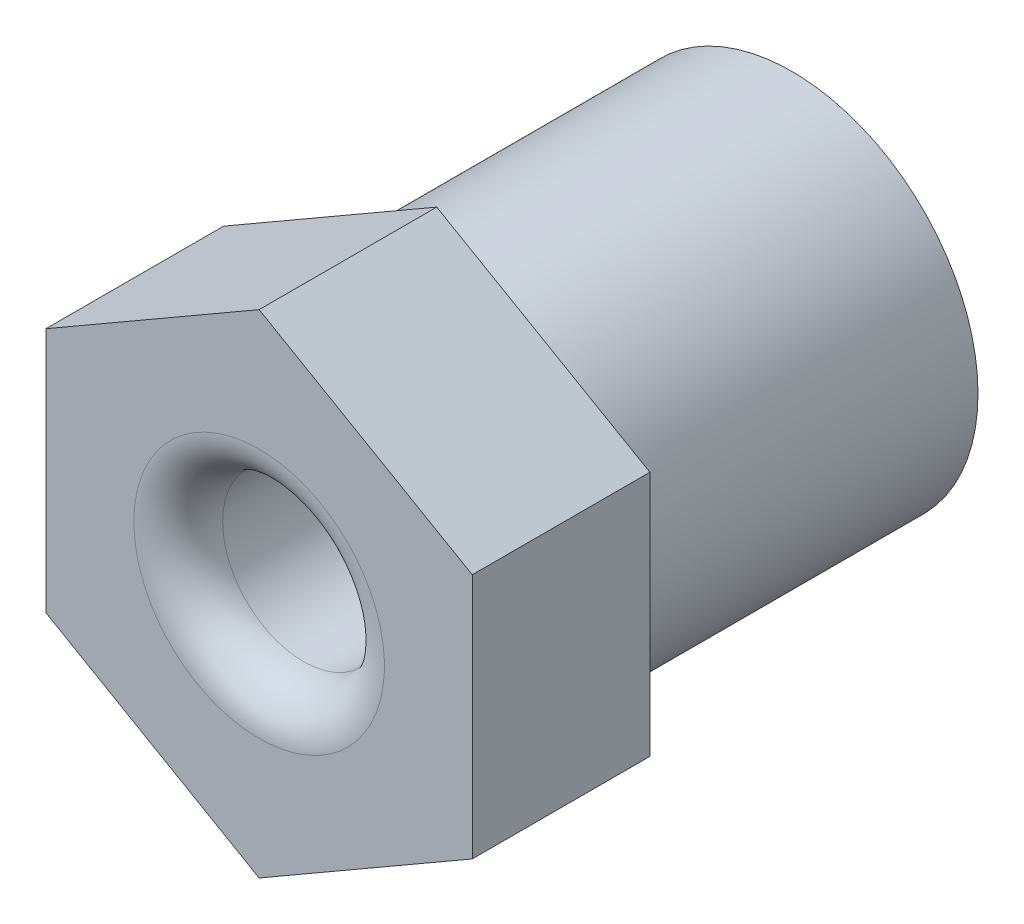
ISO-10303-21;
HEADER;
FILE_DESCRIPTION(('STEP AP214'),'2;1');
FILE_NAME('part.step','',(''),(''),'','','');
FILE_SCHEMA(('AUTOMOTIVE_DESIGN { 1 0 10303 214 1 1 1 1 }'));
ENDSEC;
DATA;
#1=APPLICATION_CONTEXT('core data for automotive mechanical design processes');
#2=APPLICATION_PROTOCOL_DEFINITION('international standard','automotive_design',2000,#1);
#3=PRODUCT_CONTEXT('',#1,'mechanical');
#4=PRODUCT('Part','Part','',(#3));
#5=PRODUCT_RELATED_PRODUCT_CATEGORY('part','',(#4));
#6=PRODUCT_DEFINITION_FORMATION('','',#4);
#7=PRODUCT_DEFINITION_CONTEXT('part definition',#1,'design');
#8=PRODUCT_DEFINITION('design','',#6,#7);
#9=PRODUCT_DEFINITION_SHAPE('','',#8);
#10=(LENGTH_UNIT() NAMED_UNIT(*) SI_UNIT(.MILLI.,.METRE.));
#11=(NAMED_UNIT(*) PLANE_ANGLE_UNIT() SI_UNIT($,.RADIAN.));
#12=(NAMED_UNIT(*) SI_UNIT($,.STERADIAN.) SOLID_ANGLE_UNIT());
#13=UNCERTAINTY_MEASURE_WITH_UNIT(LENGTH_MEASURE(1.E-05),#10,'distance_accuracy_value','');
#14=(GEOMETRIC_REPRESENTATION_CONTEXT(3) GLOBAL_UNCERTAINTY_ASSIGNED_CONTEXT((#13)) GLOBAL_UNIT_ASSIGNED_CONTEXT((#10,
#11,#12)) REPRESENTATION_CONTEXT('',''));
#15=CARTESIAN_POINT('',(0.,0.,0.));
#16=DIRECTION('',(0.,0.,1.));
#17=DIRECTION('',(1.,0.,0.));
#18=AXIS2_PLACEMENT_3D('',#15,#16,#17);
#19=CARTESIAN_POINT('',(-3.65791116486798,3.45094953686021,0.));
#20=DIRECTION('',(0.,0.,1.));
#21=DIRECTION('',(1.,0.,0.));
#22=AXIS2_PLACEMENT_3D('',#19,#20,#21);
#23=PLANE('',#22);
#24=CARTESIAN_POINT('',(-3.65791116486798,3.45094953686021,0.));
#25=DIRECTION('',(0.,0.,1.));
#26=DIRECTION('',(-1.,0.,0.));
#27=AXIS2_PLACEMENT_3D('',#24,#25,#26);
#28=CIRCLE('',#27,0.91087);
#29=CARTESIAN_POINT('',(-4.56878116486798,3.45094953686021,0.));
#30=VERTEX_POINT('',#29);
#31=EDGE_CURVE('E134',#30,#30,#28,.T.);
#32=ORIENTED_EDGE('',*,*,#31,.T.);
#33=EDGE_LOOP('',(#32));
#34=FACE_BOUND('',#33,.T.);
#35=CARTESIAN_POINT('',(-3.65791116486798,3.45094953686021,0.));
#36=DIRECTION('',(0.,0.,-1.));
#37=DIRECTION('',(1.,0.,0.));
#38=AXIS2_PLACEMENT_3D('',#35,#36,#37);
#39=CIRCLE('',#38,1.6);
#40=CARTESIAN_POINT('',(-2.05791116486798,3.45094953686021,0.));
#41=VERTEX_POINT('',#40);
#42=EDGE_CURVE('E180',#41,#41,#39,.T.);
#43=ORIENTED_EDGE('',*,*,#42,.T.);
#44=EDGE_LOOP('',(#43));
#45=FACE_BOUND('',#44,.T.);
#46=ADVANCED_FACE('F17',(#34,#45),#23,.F.);
#47=CARTESIAN_POINT('',(-1.25791116486653,4.83659053686006,0.));
#48=DIRECTION('',(1.,0.,0.));
#49=DIRECTION('',(0.,1.,0.));
#50=AXIS2_PLACEMENT_3D('',#47,#48,#49);
#51=PLANE('',#50);
#52=DIRECTION('',(0.,-1.,0.));
#53=VECTOR('',#52,1.);
#54=CARTESIAN_POINT('',(-1.25791116486653,4.83659053686006,2.));
#55=LINE('',#54,#53);
#56=CARTESIAN_POINT('',(-1.25791116486653,4.83659053686006,2.));
#57=VERTEX_POINT('',#56);
#58=CARTESIAN_POINT('',(-1.25791116486653,2.06530853686036,2.));
#59=VERTEX_POINT('',#58);
#60=EDGE_CURVE('E144',#57,#59,#55,.T.);
#61=ORIENTED_EDGE('',*,*,#60,.T.);
#62=DIRECTION('',(0.,0.,1.));
#63=VECTOR('',#62,1.);
#64=CARTESIAN_POINT('',(-1.25791116486653,2.06530853686036,0.));
#65=LINE('',#64,#63);
#66=CARTESIAN_POINT('',(-1.25791116486653,2.06530853686036,0.));
#67=VERTEX_POINT('',#66);
#68=EDGE_CURVE('E95',#67,#59,#65,.T.);
#69=ORIENTED_EDGE('',*,*,#68,.F.);
#70=DIRECTION('',(0.,-1.,0.));
#71=VECTOR('',#70,1.);
#72=CARTESIAN_POINT('',(-1.25791116486653,4.83659053686006,0.));
#73=LINE('',#72,#71);
#74=CARTESIAN_POINT('',(-1.25791116486653,4.83659053686006,0.));
#75=VERTEX_POINT('',#74);
#76=EDGE_CURVE('E115',#75,#67,#73,.T.);
#77=ORIENTED_EDGE('',*,*,#76,.F.);
#78=DIRECTION('',(0.,0.,1.));
#79=VECTOR('',#78,1.);
#80=CARTESIAN_POINT('',(-1.25791116486653,4.83659053686006,0.));
#81=LINE('',#80,#79);
#82=EDGE_CURVE('E11',#75,#57,#81,.T.);
#83=ORIENTED_EDGE('',*,*,#82,.T.);
#84=EDGE_LOOP('',(#61,#69,#77,#83));
#85=FACE_BOUND('',#84,.T.);
#86=ADVANCED_FACE('F201',(#85),#51,.T.);
#87=CARTESIAN_POINT('',(-3.65791116486798,6.22223053686048,0.));
#88=DIRECTION('',(0.499999825156066,0.866025504730608,0.));
#89=DIRECTION('',(0.,0.,-1.));
#90=AXIS2_PLACEMENT_3D('',#87,#88,#89);
#91=PLANE('',#90);
#92=DIRECTION('',(0.866025504730608,-0.499999825156065,0.));
#93=VECTOR('',#92,1.);
#94=CARTESIAN_POINT('',(-3.65791116486798,6.22223053686048,2.));
#95=LINE('',#94,#93);
#96=CARTESIAN_POINT('',(-3.65791116486798,6.22223053686048,2.));
#97=VERTEX_POINT('',#96);
#98=EDGE_CURVE('E148',#97,#57,#95,.T.);
#99=ORIENTED_EDGE('',*,*,#98,.T.);
#100=ORIENTED_EDGE('',*,*,#82,.F.);
#101=DIRECTION('',(0.866025504730608,-0.499999825156065,0.));
#102=VECTOR('',#101,1.);
#103=CARTESIAN_POINT('',(-3.65791116486798,6.22223053686048,0.));
#104=LINE('',#103,#102);
#105=CARTESIAN_POINT('',(-3.65791116486798,6.22223053686048,0.));
#106=VERTEX_POINT('',#105);
#107=EDGE_CURVE('E122',#106,#75,#104,.T.);
#108=ORIENTED_EDGE('',*,*,#107,.F.);
#109=DIRECTION('',(0.,0.,1.));
#110=VECTOR('',#109,1.);
#111=CARTESIAN_POINT('',(-3.65791116486798,6.22223053686048,0.));
#112=LINE('',#111,#110);
#113=EDGE_CURVE('E25',#106,#97,#112,.T.);
#114=ORIENTED_EDGE('',*,*,#113,.T.);
#115=EDGE_LOOP('',(#99,#100,#108,#114));
#116=FACE_BOUND('',#115,.T.);
#117=ADVANCED_FACE('F163',(#116),#91,.T.);
#118=CARTESIAN_POINT('',(-6.05791116486944,4.83659053686006,0.));
#119=DIRECTION('',(-0.499999825156066,0.866025504730608,0.));
#120=DIRECTION('',(0.,0.,1.));
#121=AXIS2_PLACEMENT_3D('',#118,#119,#120);
#122=PLANE('',#121);
#123=DIRECTION('',(0.866025504730608,0.499999825156065,0.));
#124=VECTOR('',#123,1.);
#125=CARTESIAN_POINT('',(-6.05791116486944,4.83659053686006,2.));
#126=LINE('',#125,#124);
#127=CARTESIAN_POINT('',(-6.05791116486944,4.83659053686006,2.));
#128=VERTEX_POINT('',#127);
#129=EDGE_CURVE('E149',#128,#97,#126,.T.);
#130=ORIENTED_EDGE('',*,*,#129,.T.);
#131=ORIENTED_EDGE('',*,*,#113,.F.);
#132=DIRECTION('',(0.866025504730608,0.499999825156065,0.));
#133=VECTOR('',#132,1.);
#134=CARTESIAN_POINT('',(-6.05791116486944,4.83659053686006,0.));
#135=LINE('',#134,#133);
#136=CARTESIAN_POINT('',(-6.05791116486944,4.83659053686006,0.));
#137=VERTEX_POINT('',#136);
#138=EDGE_CURVE('E103',#137,#106,#135,.T.);
#139=ORIENTED_EDGE('',*,*,#138,.F.);
#140=DIRECTION('',(0.,0.,1.));
#141=VECTOR('',#140,1.);
#142=CARTESIAN_POINT('',(-6.05791116486944,4.83659053686006,0.));
#143=LINE('',#142,#141);
#144=EDGE_CURVE('E47',#137,#128,#143,.T.);
#145=ORIENTED_EDGE('',*,*,#144,.T.);
#146=EDGE_LOOP('',(#130,#131,#139,#145));
#147=FACE_BOUND('',#146,.T.);
#148=ADVANCED_FACE('F167',(#147),#122,.T.);
#149=CARTESIAN_POINT('',(-6.05791116486944,2.06530853686036,0.));
#150=DIRECTION('',(-1.,0.,0.));
#151=DIRECTION('',(0.,0.,1.));
#152=AXIS2_PLACEMENT_3D('',#149,#150,#151);
#153=PLANE('',#152);
#154=DIRECTION('',(0.,1.,0.));
#155=VECTOR('',#154,1.);
#156=CARTESIAN_POINT('',(-6.05791116486944,2.06530853686036,2.));
#157=LINE('',#156,#155);
#158=CARTESIAN_POINT('',(-6.05791116486944,2.06530853686036,2.));
#159=VERTEX_POINT('',#158);
#160=EDGE_CURVE('E152',#159,#128,#157,.T.);
#161=ORIENTED_EDGE('',*,*,#160,.T.);
#162=ORIENTED_EDGE('',*,*,#144,.F.);
#163=DIRECTION('',(0.,1.,0.));
#164=VECTOR('',#163,1.);
#165=CARTESIAN_POINT('',(-6.05791116486944,2.06530853686036,0.));
#166=LINE('',#165,#164);
#167=CARTESIAN_POINT('',(-6.05791116486944,2.06530853686036,0.));
#168=VERTEX_POINT('',#167);
#169=EDGE_CURVE('E98',#168,#137,#166,.T.);
#170=ORIENTED_EDGE('',*,*,#169,.F.);
#171=DIRECTION('',(0.,0.,1.));
#172=VECTOR('',#171,1.);
#173=CARTESIAN_POINT('',(-6.05791116486944,2.06530853686036,0.));
#174=LINE('',#173,#172);
#175=EDGE_CURVE('E37',#168,#159,#174,.T.);
#176=ORIENTED_EDGE('',*,*,#175,.T.);
#177=EDGE_LOOP('',(#161,#162,#170,#176));
#178=FACE_BOUND('',#177,.T.);
#179=ADVANCED_FACE('F99',(#178),#153,.T.);
#180=CARTESIAN_POINT('',(-3.65791116486798,0.679668536859936,0.));
#181=DIRECTION('',(-0.499999825156065,-0.866025504730608,0.));
#182=DIRECTION('',(-0.866025504730608,0.499999825156065,0.));
#183=AXIS2_PLACEMENT_3D('',#180,#181,#182);
#184=PLANE('',#183);
#185=DIRECTION('',(-0.866025504730608,0.499999825156065,0.));
#186=VECTOR('',#185,1.);
#187=CARTESIAN_POINT('',(-3.65791116486798,0.679668536859936,2.));
#188=LINE('',#187,#186);
#189=CARTESIAN_POINT('',(-3.65791116486798,0.679668536859936,2.));
#190=VERTEX_POINT('',#189);
#191=EDGE_CURVE('E92',#190,#159,#188,.T.);
#192=ORIENTED_EDGE('',*,*,#191,.T.);
#193=ORIENTED_EDGE('',*,*,#175,.F.);
#194=DIRECTION('',(-0.866025504730608,0.499999825156065,0.));
#195=VECTOR('',#194,1.);
#196=CARTESIAN_POINT('',(-3.65791116486798,0.679668536859936,0.));
#197=LINE('',#196,#195);
#198=CARTESIAN_POINT('',(-3.65791116486798,0.679668536859936,0.));
#199=VERTEX_POINT('',#198);
#200=EDGE_CURVE('E89',#199,#168,#197,.T.);
#201=ORIENTED_EDGE('',*,*,#200,.F.);
#202=DIRECTION('',(0.,0.,1.));
#203=VECTOR('',#202,1.);
#204=CARTESIAN_POINT('',(-3.65791116486798,0.679668536859936,0.));
#205=LINE('',#204,#203);
#206=EDGE_CURVE('E155',#199,#190,#205,.T.);
#207=ORIENTED_EDGE('',*,*,#206,.T.);
#208=EDGE_LOOP('',(#192,#193,#201,#207));
#209=FACE_BOUND('',#208,.T.);
#210=ADVANCED_FACE('F87',(#209),#184,.T.);
#211=CARTESIAN_POINT('',(-1.25791116486653,2.06530853686036,0.));
#212=DIRECTION('',(0.499999825156065,-0.866025504730608,0.));
#213=DIRECTION('',(0.,0.,-1.));
#214=AXIS2_PLACEMENT_3D('',#211,#212,#213);
#215=PLANE('',#214);
#216=DIRECTION('',(-0.866025504730608,-0.499999825156065,0.));
#217=VECTOR('',#216,1.);
#218=CARTESIAN_POINT('',(-1.25791116486653,2.06530853686036,2.));
#219=LINE('',#218,#217);
#220=EDGE_CURVE('E138',#59,#190,#219,.T.);
#221=ORIENTED_EDGE('',*,*,#220,.T.);
#222=ORIENTED_EDGE('',*,*,#206,.F.);
#223=DIRECTION('',(-0.866025504730608,-0.499999825156065,0.));
#224=VECTOR('',#223,1.);
#225=CARTESIAN_POINT('',(-1.25791116486653,2.06530853686036,0.));
#226=LINE('',#225,#224);
#227=EDGE_CURVE('E108',#67,#199,#226,.T.);
#228=ORIENTED_EDGE('',*,*,#227,.F.);
#229=ORIENTED_EDGE('',*,*,#68,.T.);
#230=EDGE_LOOP('',(#221,#222,#228,#229));
#231=FACE_BOUND('',#230,.T.);
#232=ADVANCED_FACE('F203',(#231),#215,.T.);
#233=CARTESIAN_POINT('',(-3.65791116486798,3.45094953686021,2.));
#234=DIRECTION('',(0.,0.,1.));
#235=DIRECTION('',(1.,0.,0.));
#236=AXIS2_PLACEMENT_3D('',#233,#234,#235);
#237=PLANE('',#236);
#238=CARTESIAN_POINT('',(-3.65791116486798,3.45094953686021,2.));
#239=DIRECTION('',(0.,0.,1.));
#240=DIRECTION('',(-1.,0.,0.));
#241=AXIS2_PLACEMENT_3D('',#238,#239,#240);
#242=CIRCLE('',#241,1.41087);
#243=CARTESIAN_POINT('',(-5.06878116486799,3.45094953686021,2.));
#244=VERTEX_POINT('',#243);
#245=EDGE_CURVE('E130',#244,#244,#242,.T.);
#246=ORIENTED_EDGE('',*,*,#245,.F.);
#247=EDGE_LOOP('',(#246));
#248=FACE_BOUND('',#247,.T.);
#249=ORIENTED_EDGE('',*,*,#220,.F.);
#250=ORIENTED_EDGE('',*,*,#60,.F.);
#251=ORIENTED_EDGE('',*,*,#98,.F.);
#252=ORIENTED_EDGE('',*,*,#129,.F.);
#253=ORIENTED_EDGE('',*,*,#160,.F.);
#254=ORIENTED_EDGE('',*,*,#191,.F.);
#255=EDGE_LOOP('',(#249,#250,#251,#252,#253,#254));
#256=FACE_BOUND('',#255,.T.);
#257=ADVANCED_FACE('F170',(#248,#256),#237,.T.);
#258=CARTESIAN_POINT('',(-3.65791116486798,3.45094953686021,2.));
#259=DIRECTION('',(0.,0.,-1.));
#260=DIRECTION('',(-1.,0.,0.));
#261=AXIS2_PLACEMENT_3D('',#258,#259,#260);
#262=CYLINDRICAL_SURFACE('',#261,0.91087);
#263=CARTESIAN_POINT('',(-3.65791116486798,3.45094953686021,1.5));
#264=DIRECTION('',(0.,0.,-1.));
#265=DIRECTION('',(-1.,0.,0.));
#266=AXIS2_PLACEMENT_3D('',#263,#264,#265);
#267=CIRCLE('',#266,0.91087);
#268=CARTESIAN_POINT('',(-4.56878116486798,3.45094953686021,1.5));
#269=VERTEX_POINT('',#268);
#270=EDGE_CURVE('E126',#269,#269,#267,.T.);
#271=ORIENTED_EDGE('',*,*,#270,.F.);
#272=EDGE_LOOP('',(#271));
#273=FACE_BOUND('',#272,.T.);
#274=ORIENTED_EDGE('',*,*,#31,.F.);
#275=EDGE_LOOP('',(#274));
#276=FACE_BOUND('',#275,.T.);
#277=ADVANCED_FACE('F211',(#273,#276),#262,.F.);
#278=CARTESIAN_POINT('',(-3.65791116486798,3.45094953686021,1.5));
#279=DIRECTION('',(0.,0.,-1.));
#280=DIRECTION('',(-1.,0.,0.));
#281=AXIS2_PLACEMENT_3D('',#278,#279,#280);
#282=TOROIDAL_SURFACE('',#281,1.41087,0.5);
#283=ORIENTED_EDGE('',*,*,#245,.T.);
#284=EDGE_LOOP('',(#283));
#285=FACE_BOUND('',#284,.T.);
#286=ORIENTED_EDGE('',*,*,#270,.T.);
#287=EDGE_LOOP('',(#286));
#288=FACE_BOUND('',#287,.T.);
#289=ADVANCED_FACE('F344',(#285,#288),#282,.T.);
#290=CARTESIAN_POINT('',(-3.65791116486798,3.45094953686021,0.));
#291=DIRECTION('',(0.,0.,1.));
#292=DIRECTION('',(1.,0.,0.));
#293=AXIS2_PLACEMENT_3D('',#290,#291,#292);
#294=PLANE('',#293);
#295=CARTESIAN_POINT('',(-3.65791116486798,3.45094953686021,0.));
#296=DIRECTION('',(0.,0.,1.));
#297=DIRECTION('',(1.,0.,0.));
#298=AXIS2_PLACEMENT_3D('',#295,#296,#297);
#299=CIRCLE('',#298,2.095);
#300=CARTESIAN_POINT('',(-1.56291116486798,3.45094953686021,0.));
#301=VERTEX_POINT('',#300);
#302=EDGE_CURVE('E188',#301,#301,#299,.T.);
#303=ORIENTED_EDGE('',*,*,#302,.T.);
#304=EDGE_LOOP('',(#303));
#305=FACE_BOUND('',#304,.T.);
#306=ORIENTED_EDGE('',*,*,#76,.T.);
#307=ORIENTED_EDGE('',*,*,#227,.T.);
#308=ORIENTED_EDGE('',*,*,#200,.T.);
#309=ORIENTED_EDGE('',*,*,#169,.T.);
#310=ORIENTED_EDGE('',*,*,#138,.T.);
#311=ORIENTED_EDGE('',*,*,#107,.T.);
#312=EDGE_LOOP('',(#306,#307,#308,#309,#310,#311));
#313=FACE_BOUND('',#312,.T.);
#314=ADVANCED_FACE('F106',(#305,#313),#294,.F.);
#315=CARTESIAN_POINT('',(-3.65791116486798,3.45094953686021,-4.));
#316=DIRECTION('',(0.,0.,1.));
#317=DIRECTION('',(1.,0.,0.));
#318=AXIS2_PLACEMENT_3D('',#315,#316,#317);
#319=PLANE('',#318);
#320=CARTESIAN_POINT('',(-3.65791116486798,3.45094953686021,-4.));
#321=DIRECTION('',(0.,0.,1.));
#322=DIRECTION('',(1.,0.,0.));
#323=AXIS2_PLACEMENT_3D('',#320,#321,#322);
#324=CIRCLE('',#323,1.6);
#325=CARTESIAN_POINT('',(-2.05791116486798,3.45094953686021,-4.));
#326=VERTEX_POINT('',#325);
#327=EDGE_CURVE('E177',#326,#326,#324,.T.);
#328=ORIENTED_EDGE('',*,*,#327,.T.);
#329=EDGE_LOOP('',(#328));
#330=FACE_BOUND('',#329,.T.);
#331=CARTESIAN_POINT('',(-3.65791116486798,3.45094953686021,-4.));
#332=DIRECTION('',(0.,0.,1.));
#333=DIRECTION('',(1.,0.,0.));
#334=AXIS2_PLACEMENT_3D('',#331,#332,#333);
#335=CIRCLE('',#334,2.095);
#336=CARTESIAN_POINT('',(-1.56291116486798,3.45094953686021,-4.));
#337=VERTEX_POINT('',#336);
#338=EDGE_CURVE('E183',#337,#337,#335,.T.);
#339=ORIENTED_EDGE('',*,*,#338,.F.);
#340=EDGE_LOOP('',(#339));
#341=FACE_BOUND('',#340,.T.);
#342=ADVANCED_FACE('F302',(#330,#341),#319,.F.);
#343=CARTESIAN_POINT('',(-3.65791116486798,3.45094953686021,0.));
#344=DIRECTION('',(0.,0.,-1.));
#345=DIRECTION('',(1.,0.,0.));
#346=AXIS2_PLACEMENT_3D('',#343,#344,#345);
#347=CYLINDRICAL_SURFACE('',#346,2.095);
#348=ORIENTED_EDGE('',*,*,#302,.F.);
#349=EDGE_LOOP('',(#348));
#350=FACE_BOUND('',#349,.T.);
#351=ORIENTED_EDGE('',*,*,#338,.T.);
#352=EDGE_LOOP('',(#351));
#353=FACE_BOUND('',#352,.T.);
#354=ADVANCED_FACE('F229',(#350,#353),#347,.T.);
#355=CARTESIAN_POINT('',(-3.65791116486798,3.45094953686021,0.));
#356=DIRECTION('',(0.,0.,-1.));
#357=DIRECTION('',(1.,0.,0.));
#358=AXIS2_PLACEMENT_3D('',#355,#356,#357);
#359=CYLINDRICAL_SURFACE('',#358,1.6);
#360=ORIENTED_EDGE('',*,*,#42,.F.);
#361=EDGE_LOOP('',(#360));
#362=FACE_BOUND('',#361,.T.);
#363=ORIENTED_EDGE('',*,*,#327,.F.);
#364=EDGE_LOOP('',(#363));
#365=FACE_BOUND('',#364,.T.);
#366=ADVANCED_FACE('F226',(#362,#365),#359,.F.);
#367=CLOSED_SHELL('',(#46,#86,#117,#148,#179,#210,#232,#257,#277,#289,#314,#342,#354,#366));
#368=MANIFOLD_SOLID_BREP('B1',#367);
#369=ADVANCED_BREP_SHAPE_REPRESENTATION('',(#18,#368),#14);
#370=SHAPE_DEFINITION_REPRESENTATION(#9,#369);
ENDSEC;
END-ISO-10303-21;
